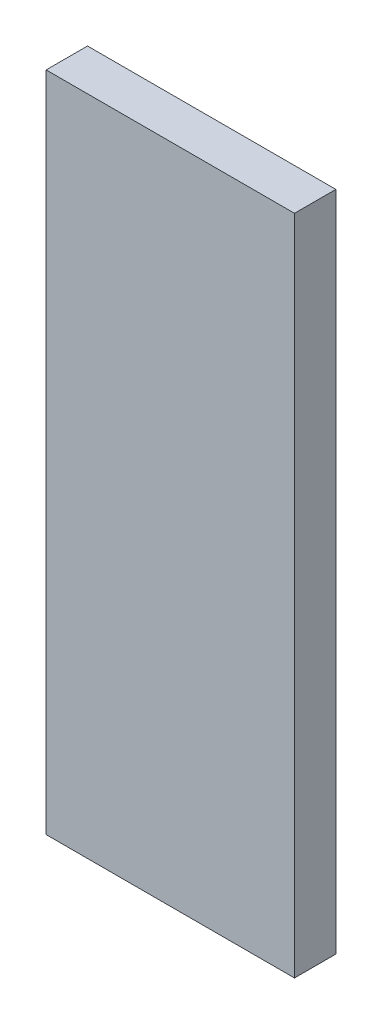
ISO-10303-21;
HEADER;
FILE_DESCRIPTION(('STEP AP214'),'2;1');
FILE_NAME('part.step','',(''),(''),'','','');
FILE_SCHEMA(('AUTOMOTIVE_DESIGN { 1 0 10303 214 1 1 1 1 }'));
ENDSEC;
DATA;
#1=APPLICATION_CONTEXT('core data for automotive mechanical design processes');
#2=APPLICATION_PROTOCOL_DEFINITION('international standard','automotive_design',2000,#1);
#3=PRODUCT_CONTEXT('',#1,'mechanical');
#4=PRODUCT('Part','Part','',(#3));
#5=PRODUCT_RELATED_PRODUCT_CATEGORY('part','',(#4));
#6=PRODUCT_DEFINITION_FORMATION('','',#4);
#7=PRODUCT_DEFINITION_CONTEXT('part definition',#1,'design');
#8=PRODUCT_DEFINITION('design','',#6,#7);
#9=PRODUCT_DEFINITION_SHAPE('','',#8);
#10=(LENGTH_UNIT() NAMED_UNIT(*) SI_UNIT(.MILLI.,.METRE.));
#11=(NAMED_UNIT(*) PLANE_ANGLE_UNIT() SI_UNIT($,.RADIAN.));
#12=(NAMED_UNIT(*) SI_UNIT($,.STERADIAN.) SOLID_ANGLE_UNIT());
#13=UNCERTAINTY_MEASURE_WITH_UNIT(LENGTH_MEASURE(1.E-05),#10,'distance_accuracy_value','');
#14=(GEOMETRIC_REPRESENTATION_CONTEXT(3) GLOBAL_UNCERTAINTY_ASSIGNED_CONTEXT((#13)) GLOBAL_UNIT_ASSIGNED_CONTEXT((#10,
#11,#12)) REPRESENTATION_CONTEXT('',''));
#15=CARTESIAN_POINT('',(0.,0.,0.));
#16=DIRECTION('',(0.,0.,1.));
#17=DIRECTION('',(1.,0.,0.));
#18=AXIS2_PLACEMENT_3D('',#15,#16,#17);
#19=CARTESIAN_POINT('',(0.,101.6,6.35));
#20=DIRECTION('',(0.,0.,1.));
#21=DIRECTION('',(1.,0.,0.));
#22=AXIS2_PLACEMENT_3D('',#19,#20,#21);
#23=PLANE('',#22);
#24=DIRECTION('',(-1.,0.,0.));
#25=VECTOR('',#24,1.);
#26=CARTESIAN_POINT('',(0.,0.,6.35));
#27=LINE('',#26,#25);
#28=CARTESIAN_POINT('',(0.,0.,6.35));
#29=VERTEX_POINT('',#28);
#30=CARTESIAN_POINT('',(-38.1,0.,6.35));
#31=VERTEX_POINT('',#30);
#32=EDGE_CURVE('E110',#29,#31,#27,.T.);
#33=ORIENTED_EDGE('',*,*,#32,.F.);
#34=DIRECTION('',(0.,-1.,0.));
#35=VECTOR('',#34,1.);
#36=CARTESIAN_POINT('',(0.,101.6,6.35));
#37=LINE('',#36,#35);
#38=CARTESIAN_POINT('',(0.,101.6,6.35));
#39=VERTEX_POINT('',#38);
#40=EDGE_CURVE('E11',#39,#29,#37,.T.);
#41=ORIENTED_EDGE('',*,*,#40,.F.);
#42=DIRECTION('',(-1.,0.,0.));
#43=VECTOR('',#42,1.);
#44=CARTESIAN_POINT('',(0.,101.6,6.35));
#45=LINE('',#44,#43);
#46=CARTESIAN_POINT('',(-38.1,101.6,6.35));
#47=VERTEX_POINT('',#46);
#48=EDGE_CURVE('E101',#39,#47,#45,.T.);
#49=ORIENTED_EDGE('',*,*,#48,.T.);
#50=DIRECTION('',(0.,-1.,0.));
#51=VECTOR('',#50,1.);
#52=CARTESIAN_POINT('',(-38.1,101.6,6.35));
#53=LINE('',#52,#51);
#54=EDGE_CURVE('E80',#47,#31,#53,.T.);
#55=ORIENTED_EDGE('',*,*,#54,.T.);
#56=EDGE_LOOP('',(#33,#41,#49,#55));
#57=FACE_BOUND('',#56,.T.);
#58=ADVANCED_FACE('F41',(#57),#23,.T.);
#59=CARTESIAN_POINT('',(0.,101.6,0.));
#60=DIRECTION('',(1.,0.,0.));
#61=DIRECTION('',(0.,0.,-1.));
#62=AXIS2_PLACEMENT_3D('',#59,#60,#61);
#63=PLANE('',#62);
#64=DIRECTION('',(0.,0.,1.));
#65=VECTOR('',#64,1.);
#66=CARTESIAN_POINT('',(0.,0.,0.));
#67=LINE('',#66,#65);
#68=CARTESIAN_POINT('',(0.,0.,0.));
#69=VERTEX_POINT('',#68);
#70=EDGE_CURVE('E93',#69,#29,#67,.T.);
#71=ORIENTED_EDGE('',*,*,#70,.F.);
#72=DIRECTION('',(0.,-1.,0.));
#73=VECTOR('',#72,1.);
#74=CARTESIAN_POINT('',(0.,101.6,0.));
#75=LINE('',#74,#73);
#76=CARTESIAN_POINT('',(0.,101.6,0.));
#77=VERTEX_POINT('',#76);
#78=EDGE_CURVE('E50',#77,#69,#75,.T.);
#79=ORIENTED_EDGE('',*,*,#78,.F.);
#80=DIRECTION('',(0.,0.,1.));
#81=VECTOR('',#80,1.);
#82=CARTESIAN_POINT('',(0.,101.6,0.));
#83=LINE('',#82,#81);
#84=EDGE_CURVE('E91',#77,#39,#83,.T.);
#85=ORIENTED_EDGE('',*,*,#84,.T.);
#86=ORIENTED_EDGE('',*,*,#40,.T.);
#87=EDGE_LOOP('',(#71,#79,#85,#86));
#88=FACE_BOUND('',#87,.T.);
#89=ADVANCED_FACE('F89',(#88),#63,.T.);
#90=CARTESIAN_POINT('',(0.,101.6,0.));
#91=DIRECTION('',(0.,0.,1.));
#92=DIRECTION('',(1.,0.,0.));
#93=AXIS2_PLACEMENT_3D('',#90,#91,#92);
#94=PLANE('',#93);
#95=DIRECTION('',(-1.,0.,0.));
#96=VECTOR('',#95,1.);
#97=CARTESIAN_POINT('',(0.,0.,0.));
#98=LINE('',#97,#96);
#99=CARTESIAN_POINT('',(-38.1,0.,0.));
#100=VERTEX_POINT('',#99);
#101=EDGE_CURVE('E73',#69,#100,#98,.T.);
#102=ORIENTED_EDGE('',*,*,#101,.T.);
#103=DIRECTION('',(0.,-1.,0.));
#104=VECTOR('',#103,1.);
#105=CARTESIAN_POINT('',(-38.1,101.6,0.));
#106=LINE('',#105,#104);
#107=CARTESIAN_POINT('',(-38.1,101.6,0.));
#108=VERTEX_POINT('',#107);
#109=EDGE_CURVE('E95',#108,#100,#106,.T.);
#110=ORIENTED_EDGE('',*,*,#109,.F.);
#111=DIRECTION('',(-1.,0.,0.));
#112=VECTOR('',#111,1.);
#113=CARTESIAN_POINT('',(0.,101.6,0.));
#114=LINE('',#113,#112);
#115=EDGE_CURVE('E96',#77,#108,#114,.T.);
#116=ORIENTED_EDGE('',*,*,#115,.F.);
#117=ORIENTED_EDGE('',*,*,#78,.T.);
#118=EDGE_LOOP('',(#102,#110,#116,#117));
#119=FACE_BOUND('',#118,.T.);
#120=ADVANCED_FACE('F97',(#119),#94,.F.);
#121=CARTESIAN_POINT('',(-38.1,101.6,0.));
#122=DIRECTION('',(1.,0.,0.));
#123=DIRECTION('',(0.,0.,-1.));
#124=AXIS2_PLACEMENT_3D('',#121,#122,#123);
#125=PLANE('',#124);
#126=DIRECTION('',(0.,0.,1.));
#127=VECTOR('',#126,1.);
#128=CARTESIAN_POINT('',(-38.1,0.,0.));
#129=LINE('',#128,#127);
#130=EDGE_CURVE('E105',#100,#31,#129,.T.);
#131=ORIENTED_EDGE('',*,*,#130,.T.);
#132=ORIENTED_EDGE('',*,*,#54,.F.);
#133=DIRECTION('',(0.,0.,1.));
#134=VECTOR('',#133,1.);
#135=CARTESIAN_POINT('',(-38.1,101.6,0.));
#136=LINE('',#135,#134);
#137=EDGE_CURVE('E58',#108,#47,#136,.T.);
#138=ORIENTED_EDGE('',*,*,#137,.F.);
#139=ORIENTED_EDGE('',*,*,#109,.T.);
#140=EDGE_LOOP('',(#131,#132,#138,#139));
#141=FACE_BOUND('',#140,.T.);
#142=ADVANCED_FACE('F125',(#141),#125,.F.);
#143=CARTESIAN_POINT('',(0.,101.6,0.));
#144=DIRECTION('',(0.,1.,0.));
#145=DIRECTION('',(0.,0.,1.));
#146=AXIS2_PLACEMENT_3D('',#143,#144,#145);
#147=PLANE('',#146);
#148=ORIENTED_EDGE('',*,*,#48,.F.);
#149=ORIENTED_EDGE('',*,*,#84,.F.);
#150=ORIENTED_EDGE('',*,*,#115,.T.);
#151=ORIENTED_EDGE('',*,*,#137,.T.);
#152=EDGE_LOOP('',(#148,#149,#150,#151));
#153=FACE_BOUND('',#152,.T.);
#154=ADVANCED_FACE('F100',(#153),#147,.T.);
#155=CARTESIAN_POINT('',(0.,0.,0.));
#156=DIRECTION('',(0.,1.,0.));
#157=DIRECTION('',(0.,0.,1.));
#158=AXIS2_PLACEMENT_3D('',#155,#156,#157);
#159=PLANE('',#158);
#160=ORIENTED_EDGE('',*,*,#32,.T.);
#161=ORIENTED_EDGE('',*,*,#130,.F.);
#162=ORIENTED_EDGE('',*,*,#101,.F.);
#163=ORIENTED_EDGE('',*,*,#70,.T.);
#164=EDGE_LOOP('',(#160,#161,#162,#163));
#165=FACE_BOUND('',#164,.T.);
#166=ADVANCED_FACE('F127',(#165),#159,.F.);
#167=CLOSED_SHELL('',(#58,#89,#120,#142,#154,#166));
#168=MANIFOLD_SOLID_BREP('B2',#167);
#169=ADVANCED_BREP_SHAPE_REPRESENTATION('',(#18,#168),#14);
#170=SHAPE_DEFINITION_REPRESENTATION(#9,#169);
ENDSEC;
END-ISO-10303-21;
